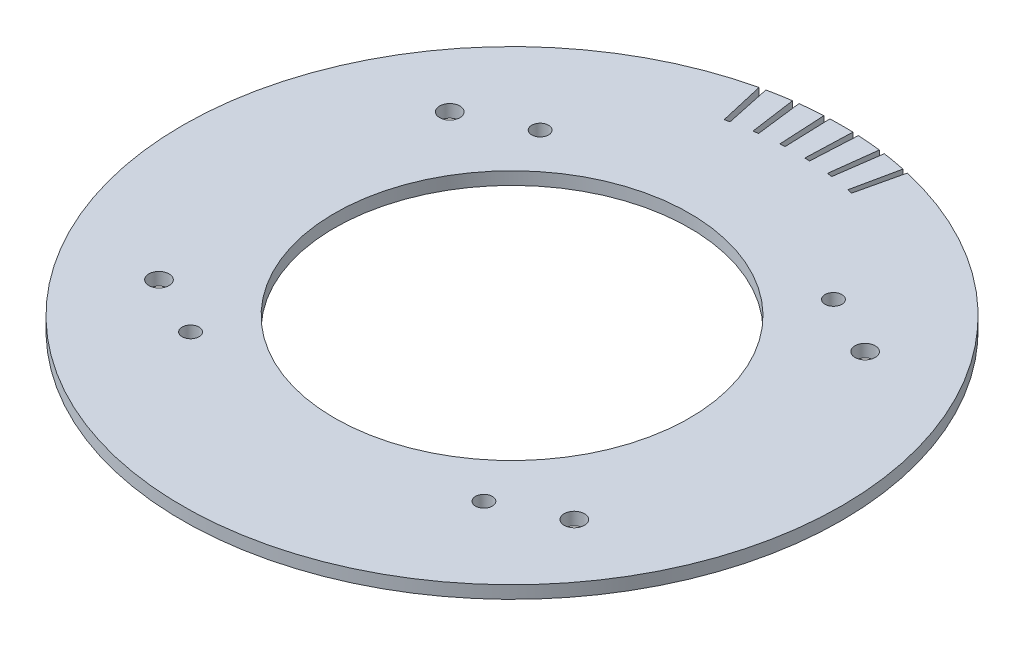
ISO-10303-21;
HEADER;
FILE_DESCRIPTION(('STEP AP214'),'2;1');
FILE_NAME('part.step','',(''),(''),'','','');
FILE_SCHEMA(('AUTOMOTIVE_DESIGN { 1 0 10303 214 1 1 1 1 }'));
ENDSEC;
DATA;
#1=APPLICATION_CONTEXT('core data for automotive mechanical design processes');
#2=APPLICATION_PROTOCOL_DEFINITION('international standard','automotive_design',2000,#1);
#3=PRODUCT_CONTEXT('',#1,'mechanical');
#4=PRODUCT('Part','Part','',(#3));
#5=PRODUCT_RELATED_PRODUCT_CATEGORY('part','',(#4));
#6=PRODUCT_DEFINITION_FORMATION('','',#4);
#7=PRODUCT_DEFINITION_CONTEXT('part definition',#1,'design');
#8=PRODUCT_DEFINITION('design','',#6,#7);
#9=PRODUCT_DEFINITION_SHAPE('','',#8);
#10=(LENGTH_UNIT() NAMED_UNIT(*) SI_UNIT(.MILLI.,.METRE.));
#11=(NAMED_UNIT(*) PLANE_ANGLE_UNIT() SI_UNIT($,.RADIAN.));
#12=(NAMED_UNIT(*) SI_UNIT($,.STERADIAN.) SOLID_ANGLE_UNIT());
#13=UNCERTAINTY_MEASURE_WITH_UNIT(LENGTH_MEASURE(1.E-05),#10,'distance_accuracy_value','');
#14=(GEOMETRIC_REPRESENTATION_CONTEXT(3) GLOBAL_UNCERTAINTY_ASSIGNED_CONTEXT((#13)) GLOBAL_UNIT_ASSIGNED_CONTEXT((#10,
#11,#12)) REPRESENTATION_CONTEXT('',''));
#15=CARTESIAN_POINT('',(0.,0.,0.));
#16=DIRECTION('',(0.,0.,1.));
#17=DIRECTION('',(1.,0.,0.));
#18=AXIS2_PLACEMENT_3D('',#15,#16,#17);
#19=CARTESIAN_POINT('',(0.,-1.905,0.));
#20=DIRECTION('',(0.,1.,0.));
#21=DIRECTION('',(0.,0.,1.));
#22=AXIS2_PLACEMENT_3D('',#19,#20,#21);
#23=CYLINDRICAL_SURFACE('',#22,99.06);
#24=CARTESIAN_POINT('',(0.,1.905,0.));
#25=DIRECTION('',(0.,1.,0.));
#26=DIRECTION('',(0.,0.,1.));
#27=AXIS2_PLACEMENT_3D('',#24,#25,#26);
#28=CIRCLE('',#27,99.06);
#29=CARTESIAN_POINT('',(-13.7864873811041,1.905,-98.09595488954));
#30=VERTEX_POINT('',#29);
#31=CARTESIAN_POINT('',(-20.5957320924073,1.905,-96.8953013286908));
#32=VERTEX_POINT('',#31);
#33=EDGE_CURVE('E418',#30,#32,#28,.T.);
#34=ORIENTED_EDGE('',*,*,#33,.F.);
#35=DIRECTION('',(0.,1.,0.));
#36=VECTOR('',#35,1.);
#37=CARTESIAN_POINT('',(-13.7864873811041,-1.905,-98.09595488954));
#38=LINE('',#37,#36);
#39=CARTESIAN_POINT('',(-13.7864873811041,-1.905,-98.09595488954));
#40=VERTEX_POINT('',#39);
#41=EDGE_CURVE('E248',#40,#30,#38,.T.);
#42=ORIENTED_EDGE('',*,*,#41,.F.);
#43=CARTESIAN_POINT('',(0.,-1.905,0.));
#44=DIRECTION('',(0.,1.,0.));
#45=DIRECTION('',(0.,0.,1.));
#46=AXIS2_PLACEMENT_3D('',#43,#44,#45);
#47=CIRCLE('',#46,99.06);
#48=CARTESIAN_POINT('',(-20.5957320924073,-1.905,-96.8953013286908));
#49=VERTEX_POINT('',#48);
#50=EDGE_CURVE('E437',#40,#49,#47,.T.);
#51=ORIENTED_EDGE('',*,*,#50,.T.);
#52=DIRECTION('',(0.,1.,0.));
#53=VECTOR('',#52,1.);
#54=CARTESIAN_POINT('',(-20.5957320924073,-1.905,-96.8953013286908));
#55=LINE('',#54,#53);
#56=EDGE_CURVE('E422',#49,#32,#55,.T.);
#57=ORIENTED_EDGE('',*,*,#56,.T.);
#58=EDGE_LOOP('',(#34,#42,#51,#57));
#59=FACE_BOUND('',#58,.T.);
#60=ADVANCED_FACE('F41',(#59),#23,.T.);
#61=DIRECTION('',(0.,1.,0.));
#62=VECTOR('',#61,1.);
#63=CARTESIAN_POINT('',(-12.0723771577139,-1.905,-98.3216217815893));
#64=LINE('',#63,#62);
#65=CARTESIAN_POINT('',(-12.0723771577139,-1.905,-98.3216217815893));
#66=VERTEX_POINT('',#65);
#67=CARTESIAN_POINT('',(-12.0723771577139,1.905,-98.3216217815893));
#68=VERTEX_POINT('',#67);
#69=EDGE_CURVE('E211',#66,#68,#64,.T.);
#70=ORIENTED_EDGE('',*,*,#69,.T.);
#71=CARTESIAN_POINT('',(-5.18439982542604,1.905,-98.9242417127881));
#72=VERTEX_POINT('',#71);
#73=EDGE_CURVE('E486',#72,#68,#28,.T.);
#74=ORIENTED_EDGE('',*,*,#73,.F.);
#75=DIRECTION('',(0.,1.,0.));
#76=VECTOR('',#75,1.);
#77=CARTESIAN_POINT('',(-5.18439982542604,-1.905,-98.9242417127881));
#78=LINE('',#77,#76);
#79=CARTESIAN_POINT('',(-5.18439982542604,-1.905,-98.9242417127881));
#80=VERTEX_POINT('',#79);
#81=EDGE_CURVE('E276',#80,#72,#78,.T.);
#82=ORIENTED_EDGE('',*,*,#81,.F.);
#83=EDGE_CURVE('E448',#80,#66,#47,.T.);
#84=ORIENTED_EDGE('',*,*,#83,.T.);
#85=EDGE_LOOP('',(#70,#74,#82,#84));
#86=FACE_BOUND('',#85,.T.);
#87=ADVANCED_FACE('F499',(#86),#23,.T.);
#88=DIRECTION('',(0.,1.,0.));
#89=VECTOR('',#88,1.);
#90=CARTESIAN_POINT('',(-3.45714414334976,-1.905,-98.9996553245116));
#91=LINE('',#90,#89);
#92=CARTESIAN_POINT('',(-3.45714414334976,-1.905,-98.9996553245116));
#93=VERTEX_POINT('',#92);
#94=CARTESIAN_POINT('',(-3.45714414334976,1.905,-98.9996553245116));
#95=VERTEX_POINT('',#94);
#96=EDGE_CURVE('E279',#93,#95,#91,.T.);
#97=ORIENTED_EDGE('',*,*,#96,.T.);
#98=CARTESIAN_POINT('',(3.45714414334975,1.905,-98.9996553245116));
#99=VERTEX_POINT('',#98);
#100=EDGE_CURVE('E481',#99,#95,#28,.T.);
#101=ORIENTED_EDGE('',*,*,#100,.F.);
#102=DIRECTION('',(0.,1.,0.));
#103=VECTOR('',#102,1.);
#104=CARTESIAN_POINT('',(3.45714414334975,-1.905,-98.9996553245116));
#105=LINE('',#104,#103);
#106=CARTESIAN_POINT('',(3.45714414334975,-1.905,-98.9996553245116));
#107=VERTEX_POINT('',#106);
#108=EDGE_CURVE('E311',#107,#99,#105,.T.);
#109=ORIENTED_EDGE('',*,*,#108,.F.);
#110=EDGE_CURVE('E453',#107,#93,#47,.T.);
#111=ORIENTED_EDGE('',*,*,#110,.T.);
#112=EDGE_LOOP('',(#97,#101,#109,#111));
#113=FACE_BOUND('',#112,.T.);
#114=ADVANCED_FACE('F503',(#113),#23,.T.);
#115=DIRECTION('',(0.,1.,0.));
#116=VECTOR('',#115,1.);
#117=CARTESIAN_POINT('',(5.18439982542603,-1.905,-98.9242417127881));
#118=LINE('',#117,#116);
#119=CARTESIAN_POINT('',(5.18439982542603,-1.905,-98.9242417127881));
#120=VERTEX_POINT('',#119);
#121=CARTESIAN_POINT('',(5.18439982542603,1.905,-98.9242417127881));
#122=VERTEX_POINT('',#121);
#123=EDGE_CURVE('E314',#120,#122,#118,.T.);
#124=ORIENTED_EDGE('',*,*,#123,.T.);
#125=CARTESIAN_POINT('',(12.0723771577139,1.905,-98.3216217815893));
#126=VERTEX_POINT('',#125);
#127=EDGE_CURVE('E479',#126,#122,#28,.T.);
#128=ORIENTED_EDGE('',*,*,#127,.F.);
#129=DIRECTION('',(0.,1.,0.));
#130=VECTOR('',#129,1.);
#131=CARTESIAN_POINT('',(12.0723771577139,-1.905,-98.3216217815893));
#132=LINE('',#131,#130);
#133=CARTESIAN_POINT('',(12.0723771577139,-1.905,-98.3216217815893));
#134=VERTEX_POINT('',#133);
#135=EDGE_CURVE('E347',#134,#126,#132,.T.);
#136=ORIENTED_EDGE('',*,*,#135,.F.);
#137=EDGE_CURVE('E446',#134,#120,#47,.T.);
#138=ORIENTED_EDGE('',*,*,#137,.T.);
#139=EDGE_LOOP('',(#124,#128,#136,#138));
#140=FACE_BOUND('',#139,.T.);
#141=ADVANCED_FACE('F466',(#140),#23,.T.);
#142=DIRECTION('',(0.,1.,0.));
#143=VECTOR('',#142,1.);
#144=CARTESIAN_POINT('',(13.7864873811041,-1.905,-98.0959548895399));
#145=LINE('',#144,#143);
#146=CARTESIAN_POINT('',(13.7864873811041,-1.905,-98.0959548895399));
#147=VERTEX_POINT('',#146);
#148=CARTESIAN_POINT('',(13.7864873811041,1.905,-98.0959548895399));
#149=VERTEX_POINT('',#148);
#150=EDGE_CURVE('E350',#147,#149,#145,.T.);
#151=ORIENTED_EDGE('',*,*,#150,.T.);
#152=CARTESIAN_POINT('',(20.5957320924073,1.905,-96.8953013286908));
#153=VERTEX_POINT('',#152);
#154=EDGE_CURVE('E434',#153,#149,#28,.T.);
#155=ORIENTED_EDGE('',*,*,#154,.F.);
#156=DIRECTION('',(0.,1.,0.));
#157=VECTOR('',#156,1.);
#158=CARTESIAN_POINT('',(20.5957320924073,-1.905,-96.8953013286908));
#159=LINE('',#158,#157);
#160=CARTESIAN_POINT('',(20.5957320924073,-1.905,-96.8953013286908));
#161=VERTEX_POINT('',#160);
#162=EDGE_CURVE('E382',#161,#153,#159,.T.);
#163=ORIENTED_EDGE('',*,*,#162,.F.);
#164=EDGE_CURVE('E440',#161,#147,#47,.T.);
#165=ORIENTED_EDGE('',*,*,#164,.T.);
#166=EDGE_LOOP('',(#151,#155,#163,#165));
#167=FACE_BOUND('',#166,.T.);
#168=ADVANCED_FACE('F506',(#167),#23,.T.);
#169=CARTESIAN_POINT('',(0.,-1.905,0.));
#170=DIRECTION('',(0.,1.,0.));
#171=DIRECTION('',(0.,0.,1.));
#172=AXIS2_PLACEMENT_3D('',#169,#170,#171);
#173=PLANE('',#172);
#174=CARTESIAN_POINT('',(-44.082374272303,-1.905,52.5353279090994));
#175=DIRECTION('',(0.,-1.,0.));
#176=DIRECTION('',(0.,0.,-1.));
#177=AXIS2_PLACEMENT_3D('',#174,#175,#176);
#178=CIRCLE('',#177,2.54000000000001);
#179=CARTESIAN_POINT('',(-44.082374272303,-1.905,49.9953279090994));
#180=VERTEX_POINT('',#179);
#181=EDGE_CURVE('E797',#180,#180,#178,.T.);
#182=ORIENTED_EDGE('',*,*,#181,.F.);
#183=EDGE_LOOP('',(#182));
#184=FACE_BOUND('',#183,.T.);
#185=CARTESIAN_POINT('',(44.082374272303,-1.905,52.5353279090994));
#186=DIRECTION('',(0.,-1.,0.));
#187=DIRECTION('',(0.,0.,-1.));
#188=AXIS2_PLACEMENT_3D('',#185,#186,#187);
#189=CIRCLE('',#188,2.54000000000001);
#190=CARTESIAN_POINT('',(44.082374272303,-1.905,49.9953279090994));
#191=VERTEX_POINT('',#190);
#192=EDGE_CURVE('E811',#191,#191,#189,.T.);
#193=ORIENTED_EDGE('',*,*,#192,.F.);
#194=EDGE_LOOP('',(#193));
#195=FACE_BOUND('',#194,.T.);
#196=CARTESIAN_POINT('',(62.4193857748213,-1.905,43.7065244499496));
#197=DIRECTION('',(0.,-1.,0.));
#198=DIRECTION('',(0.,0.,-1.));
#199=AXIS2_PLACEMENT_3D('',#196,#197,#198);
#200=CIRCLE('',#199,3.04800000000002);
#201=CARTESIAN_POINT('',(62.4193857748213,-1.905,40.6585244499496));
#202=VERTEX_POINT('',#201);
#203=EDGE_CURVE('E819',#202,#202,#200,.T.);
#204=ORIENTED_EDGE('',*,*,#203,.F.);
#205=EDGE_LOOP('',(#204));
#206=FACE_BOUND('',#205,.T.);
#207=CARTESIAN_POINT('',(62.4193857748213,-1.905,-43.7065244499496));
#208=DIRECTION('',(0.,-1.,0.));
#209=DIRECTION('',(0.,0.,-1.));
#210=AXIS2_PLACEMENT_3D('',#207,#208,#209);
#211=CIRCLE('',#210,3.04800000000002);
#212=CARTESIAN_POINT('',(62.4193857748213,-1.905,-46.7545244499496));
#213=VERTEX_POINT('',#212);
#214=EDGE_CURVE('E827',#213,#213,#211,.T.);
#215=ORIENTED_EDGE('',*,*,#214,.F.);
#216=EDGE_LOOP('',(#215));
#217=FACE_BOUND('',#216,.T.);
#218=CARTESIAN_POINT('',(44.082374272303,-1.905,-52.5353279090994));
#219=DIRECTION('',(0.,-1.,0.));
#220=DIRECTION('',(0.,0.,-1.));
#221=AXIS2_PLACEMENT_3D('',#218,#219,#220);
#222=CIRCLE('',#221,2.54);
#223=CARTESIAN_POINT('',(44.082374272303,-1.905,-55.0753279090994));
#224=VERTEX_POINT('',#223);
#225=EDGE_CURVE('E868',#224,#224,#222,.T.);
#226=ORIENTED_EDGE('',*,*,#225,.F.);
#227=EDGE_LOOP('',(#226));
#228=FACE_BOUND('',#227,.T.);
#229=CARTESIAN_POINT('',(-44.082374272303,-1.905,-52.5353279090994));
#230=DIRECTION('',(0.,-1.,0.));
#231=DIRECTION('',(0.,0.,-1.));
#232=AXIS2_PLACEMENT_3D('',#229,#230,#231);
#233=CIRCLE('',#232,2.54);
#234=CARTESIAN_POINT('',(-44.082374272303,-1.905,-55.0753279090994));
#235=VERTEX_POINT('',#234);
#236=EDGE_CURVE('E858',#235,#235,#233,.T.);
#237=ORIENTED_EDGE('',*,*,#236,.F.);
#238=EDGE_LOOP('',(#237));
#239=FACE_BOUND('',#238,.T.);
#240=CARTESIAN_POINT('',(-62.4193857748213,-1.905,-43.7065244499496));
#241=DIRECTION('',(0.,-1.,0.));
#242=DIRECTION('',(0.,0.,-1.));
#243=AXIS2_PLACEMENT_3D('',#240,#241,#242);
#244=CIRCLE('',#243,3.04800000000002);
#245=CARTESIAN_POINT('',(-62.4193857748213,-1.905,-46.7545244499496));
#246=VERTEX_POINT('',#245);
#247=EDGE_CURVE('E859',#246,#246,#244,.T.);
#248=ORIENTED_EDGE('',*,*,#247,.F.);
#249=EDGE_LOOP('',(#248));
#250=FACE_BOUND('',#249,.T.);
#251=CARTESIAN_POINT('',(-62.4193857748213,-1.905,43.7065244499496));
#252=DIRECTION('',(0.,-1.,0.));
#253=DIRECTION('',(0.,0.,-1.));
#254=AXIS2_PLACEMENT_3D('',#251,#252,#253);
#255=CIRCLE('',#254,3.048);
#256=CARTESIAN_POINT('',(-62.4193857748213,-1.905,40.6585244499496));
#257=VERTEX_POINT('',#256);
#258=EDGE_CURVE('E802',#257,#257,#255,.T.);
#259=ORIENTED_EDGE('',*,*,#258,.F.);
#260=EDGE_LOOP('',(#259));
#261=FACE_BOUND('',#260,.T.);
#262=CARTESIAN_POINT('',(0.,-1.905,0.));
#263=DIRECTION('',(0.,1.,0.));
#264=DIRECTION('',(0.,0.,1.));
#265=AXIS2_PLACEMENT_3D('',#262,#263,#264);
#266=CIRCLE('',#265,53.34);
#267=CARTESIAN_POINT('',(0.,-1.905,53.34));
#268=VERTEX_POINT('',#267);
#269=EDGE_CURVE('E11',#268,#268,#266,.T.);
#270=ORIENTED_EDGE('',*,*,#269,.T.);
#271=EDGE_LOOP('',(#270));
#272=FACE_BOUND('',#271,.T.);
#273=DIRECTION('',(-0.139173100960066,0.,-0.99026806874157));
#274=VECTOR('',#273,1.);
#275=CARTESIAN_POINT('',(0.,-1.905,0.));
#276=LINE('',#275,#274);
#277=CARTESIAN_POINT('',(-11.842239160692,-1.905,-84.2619099692202));
#278=VERTEX_POINT('',#277);
#279=EDGE_CURVE('E212',#278,#40,#276,.T.);
#280=ORIENTED_EDGE('',*,*,#279,.F.);
#281=CARTESIAN_POINT('',(0.,-1.905,0.));
#282=DIRECTION('',(0.,1.,0.));
#283=DIRECTION('',(-0.0871557427476584,0.,0.996194698091746));
#284=AXIS2_PLACEMENT_3D('',#281,#282,#283);
#285=CIRCLE('',#284,85.09);
#286=CARTESIAN_POINT('',(-10.369862430344,-1.905,-84.4557520431601));
#287=VERTEX_POINT('',#286);
#288=EDGE_CURVE('E206',#287,#278,#285,.T.);
#289=ORIENTED_EDGE('',*,*,#288,.F.);
#290=DIRECTION('',(-0.121869343405148,0.,-0.992546151641322));
#291=VECTOR('',#290,1.);
#292=CARTESIAN_POINT('',(0.,-1.905,0.));
#293=LINE('',#292,#291);
#294=EDGE_CURVE('E215',#287,#66,#293,.T.);
#295=ORIENTED_EDGE('',*,*,#294,.T.);
#296=ORIENTED_EDGE('',*,*,#83,.F.);
#297=DIRECTION('',(-0.0523359562429441,0.,-0.998629534754574));
#298=VECTOR('',#297,1.);
#299=CARTESIAN_POINT('',(0.,-1.905,0.));
#300=LINE('',#299,#298);
#301=CARTESIAN_POINT('',(-4.45326651671211,-1.905,-84.9733871122667));
#302=VERTEX_POINT('',#301);
#303=EDGE_CURVE('E261',#302,#80,#300,.T.);
#304=ORIENTED_EDGE('',*,*,#303,.F.);
#305=CARTESIAN_POINT('',(0.,-1.905,0.));
#306=DIRECTION('',(0.,1.,0.));
#307=DIRECTION('',(-0.173648177666931,0.,0.984807753012208));
#308=AXIS2_PLACEMENT_3D('',#305,#306,#307);
#309=CIRCLE('',#308,85.09);
#310=CARTESIAN_POINT('',(-2.96959817441582,-1.905,-85.0381654710549));
#311=VERTEX_POINT('',#310);
#312=EDGE_CURVE('E253',#311,#302,#309,.T.);
#313=ORIENTED_EDGE('',*,*,#312,.F.);
#314=DIRECTION('',(-0.0348994967025011,0.,-0.999390827019096));
#315=VECTOR('',#314,1.);
#316=CARTESIAN_POINT('',(0.,-1.905,0.));
#317=LINE('',#316,#315);
#318=EDGE_CURVE('E256',#311,#93,#317,.T.);
#319=ORIENTED_EDGE('',*,*,#318,.T.);
#320=ORIENTED_EDGE('',*,*,#110,.F.);
#321=DIRECTION('',(0.034899496702501,0.,-0.999390827019096));
#322=VECTOR('',#321,1.);
#323=CARTESIAN_POINT('',(0.,-1.905,0.));
#324=LINE('',#323,#322);
#325=CARTESIAN_POINT('',(2.96959817441581,-1.905,-85.0381654710549));
#326=VERTEX_POINT('',#325);
#327=EDGE_CURVE('E293',#326,#107,#324,.T.);
#328=ORIENTED_EDGE('',*,*,#327,.F.);
#329=CARTESIAN_POINT('',(0.,-1.905,0.));
#330=DIRECTION('',(0.,1.,0.));
#331=DIRECTION('',(-0.258819045102521,0.,0.965925826289068));
#332=AXIS2_PLACEMENT_3D('',#329,#330,#331);
#333=CIRCLE('',#332,85.09);
#334=CARTESIAN_POINT('',(4.4532665167121,-1.905,-84.9733871122667));
#335=VERTEX_POINT('',#334);
#336=EDGE_CURVE('E285',#335,#326,#333,.T.);
#337=ORIENTED_EDGE('',*,*,#336,.F.);
#338=DIRECTION('',(0.0523359562429439,0.,-0.998629534754574));
#339=VECTOR('',#338,1.);
#340=CARTESIAN_POINT('',(0.,-1.905,0.));
#341=LINE('',#340,#339);
#342=EDGE_CURVE('E288',#335,#120,#341,.T.);
#343=ORIENTED_EDGE('',*,*,#342,.T.);
#344=ORIENTED_EDGE('',*,*,#137,.F.);
#345=DIRECTION('',(0.121869343405148,0.,-0.992546151641322));
#346=VECTOR('',#345,1.);
#347=CARTESIAN_POINT('',(0.,-1.905,0.));
#348=LINE('',#347,#346);
#349=CARTESIAN_POINT('',(10.369862430344,-1.905,-84.4557520431601));
#350=VERTEX_POINT('',#349);
#351=EDGE_CURVE('E329',#350,#134,#348,.T.);
#352=ORIENTED_EDGE('',*,*,#351,.F.);
#353=CARTESIAN_POINT('',(0.,-1.905,0.));
#354=DIRECTION('',(0.,1.,0.));
#355=DIRECTION('',(-0.342020143325669,0.,0.939692620785908));
#356=AXIS2_PLACEMENT_3D('',#353,#354,#355);
#357=CIRCLE('',#356,85.09);
#358=CARTESIAN_POINT('',(11.842239160692,-1.905,-84.2619099692202));
#359=VERTEX_POINT('',#358);
#360=EDGE_CURVE('E321',#359,#350,#357,.T.);
#361=ORIENTED_EDGE('',*,*,#360,.F.);
#362=DIRECTION('',(0.139173100960066,0.,-0.99026806874157));
#363=VECTOR('',#362,1.);
#364=CARTESIAN_POINT('',(0.,-1.905,0.));
#365=LINE('',#364,#363);
#366=EDGE_CURVE('E324',#359,#147,#365,.T.);
#367=ORIENTED_EDGE('',*,*,#366,.T.);
#368=ORIENTED_EDGE('',*,*,#164,.F.);
#369=DIRECTION('',(0.20791169081776,0.,-0.978147600733806));
#370=VECTOR('',#369,1.);
#371=CARTESIAN_POINT('',(0.,-1.905,0.));
#372=LINE('',#371,#370);
#373=CARTESIAN_POINT('',(17.6912057716832,-1.905,-83.2305793464395));
#374=VERTEX_POINT('',#373);
#375=EDGE_CURVE('E365',#374,#161,#372,.T.);
#376=ORIENTED_EDGE('',*,*,#375,.F.);
#377=CARTESIAN_POINT('',(0.,-1.905,0.));
#378=DIRECTION('',(0.,1.,0.));
#379=DIRECTION('',(-0.4226182617407,0.,0.90630778703665));
#380=AXIS2_PLACEMENT_3D('',#377,#378,#379);
#381=CIRCLE('',#380,85.09);
#382=CARTESIAN_POINT('',(19.1410852141195,-1.905,-82.9091488125757));
#383=VERTEX_POINT('',#382);
#384=EDGE_CURVE('E357',#383,#374,#381,.T.);
#385=ORIENTED_EDGE('',*,*,#384,.F.);
#386=DIRECTION('',(0.224951054343865,0.,-0.974370064785235));
#387=VECTOR('',#386,1.);
#388=CARTESIAN_POINT('',(0.,-1.905,0.));
#389=LINE('',#388,#387);
#390=CARTESIAN_POINT('',(22.2836514433033,-1.905,-96.5210986176254));
#391=VERTEX_POINT('',#390);
#392=EDGE_CURVE('E360',#383,#391,#389,.T.);
#393=ORIENTED_EDGE('',*,*,#392,.T.);
#394=CARTESIAN_POINT('',(-22.2836514433033,-1.905,-96.5210986176254));
#395=VERTEX_POINT('',#394);
#396=EDGE_CURVE('E50',#395,#391,#47,.T.);
#397=ORIENTED_EDGE('',*,*,#396,.F.);
#398=DIRECTION('',(-0.224951054343866,0.,-0.974370064785235));
#399=VECTOR('',#398,1.);
#400=CARTESIAN_POINT('',(0.,-1.905,0.));
#401=LINE('',#400,#399);
#402=CARTESIAN_POINT('',(-19.1410852141195,-1.905,-82.9091488125757));
#403=VERTEX_POINT('',#402);
#404=EDGE_CURVE('E400',#403,#395,#401,.T.);
#405=ORIENTED_EDGE('',*,*,#404,.F.);
#406=CARTESIAN_POINT('',(0.,-1.905,0.));
#407=DIRECTION('',(0.,1.,0.));
#408=DIRECTION('',(0.,0.,1.));
#409=AXIS2_PLACEMENT_3D('',#406,#407,#408);
#410=CIRCLE('',#409,85.09);
#411=CARTESIAN_POINT('',(-17.6912057716832,-1.905,-83.2305793464395));
#412=VERTEX_POINT('',#411);
#413=EDGE_CURVE('E392',#412,#403,#410,.T.);
#414=ORIENTED_EDGE('',*,*,#413,.F.);
#415=DIRECTION('',(-0.20791169081776,0.,-0.978147600733805));
#416=VECTOR('',#415,1.);
#417=CARTESIAN_POINT('',(0.,-1.905,0.));
#418=LINE('',#417,#416);
#419=EDGE_CURVE('E395',#412,#49,#418,.T.);
#420=ORIENTED_EDGE('',*,*,#419,.T.);
#421=ORIENTED_EDGE('',*,*,#50,.F.);
#422=EDGE_LOOP('',(#280,#289,#295,#296,#304,#313,#319,#320,#328,#337,#343,#344,#352,#361,#367,
#368,#376,#385,#393,#397,#405,#414,#420,#421));
#423=FACE_BOUND('',#422,.T.);
#424=ADVANCED_FACE('F224',(#184,#195,#206,#217,#228,#239,#250,#261,#272,#423),#173,.F.);
#425=CARTESIAN_POINT('',(0.,1.905,0.));
#426=DIRECTION('',(0.,1.,0.));
#427=DIRECTION('',(0.,0.,1.));
#428=AXIS2_PLACEMENT_3D('',#425,#426,#427);
#429=PLANE('',#428);
#430=CARTESIAN_POINT('',(-44.082374272303,1.905,52.5353279090994));
#431=DIRECTION('',(0.,1.,0.));
#432=DIRECTION('',(0.,0.,1.));
#433=AXIS2_PLACEMENT_3D('',#430,#431,#432);
#434=CIRCLE('',#433,2.54000000000001);
#435=CARTESIAN_POINT('',(-44.082374272303,1.905,55.0753279090994));
#436=VERTEX_POINT('',#435);
#437=EDGE_CURVE('E800',#436,#436,#434,.F.);
#438=ORIENTED_EDGE('',*,*,#437,.T.);
#439=EDGE_LOOP('',(#438));
#440=FACE_BOUND('',#439,.T.);
#441=CARTESIAN_POINT('',(44.082374272303,1.905,52.5353279090994));
#442=DIRECTION('',(0.,1.,0.));
#443=DIRECTION('',(0.,0.,1.));
#444=AXIS2_PLACEMENT_3D('',#441,#442,#443);
#445=CIRCLE('',#444,2.54000000000001);
#446=CARTESIAN_POINT('',(44.082374272303,1.905,55.0753279090994));
#447=VERTEX_POINT('',#446);
#448=EDGE_CURVE('E807',#447,#447,#445,.F.);
#449=ORIENTED_EDGE('',*,*,#448,.T.);
#450=EDGE_LOOP('',(#449));
#451=FACE_BOUND('',#450,.T.);
#452=CARTESIAN_POINT('',(62.4193857748213,1.905,43.7065244499496));
#453=DIRECTION('',(0.,1.,0.));
#454=DIRECTION('',(0.,0.,1.));
#455=AXIS2_PLACEMENT_3D('',#452,#453,#454);
#456=CIRCLE('',#455,3.04800000000002);
#457=CARTESIAN_POINT('',(62.4193857748213,1.905,46.7545244499496));
#458=VERTEX_POINT('',#457);
#459=EDGE_CURVE('E815',#458,#458,#456,.F.);
#460=ORIENTED_EDGE('',*,*,#459,.T.);
#461=EDGE_LOOP('',(#460));
#462=FACE_BOUND('',#461,.T.);
#463=CARTESIAN_POINT('',(62.4193857748213,1.905,-43.7065244499496));
#464=DIRECTION('',(0.,1.,0.));
#465=DIRECTION('',(0.,0.,1.));
#466=AXIS2_PLACEMENT_3D('',#463,#464,#465);
#467=CIRCLE('',#466,3.04800000000002);
#468=CARTESIAN_POINT('',(62.4193857748213,1.905,-40.6585244499496));
#469=VERTEX_POINT('',#468);
#470=EDGE_CURVE('E823',#469,#469,#467,.F.);
#471=ORIENTED_EDGE('',*,*,#470,.T.);
#472=EDGE_LOOP('',(#471));
#473=FACE_BOUND('',#472,.T.);
#474=CARTESIAN_POINT('',(44.082374272303,1.905,-52.5353279090994));
#475=DIRECTION('',(0.,1.,0.));
#476=DIRECTION('',(0.,0.,1.));
#477=AXIS2_PLACEMENT_3D('',#474,#475,#476);
#478=CIRCLE('',#477,2.54);
#479=CARTESIAN_POINT('',(44.082374272303,1.905,-49.9953279090994));
#480=VERTEX_POINT('',#479);
#481=EDGE_CURVE('E831',#480,#480,#478,.F.);
#482=ORIENTED_EDGE('',*,*,#481,.T.);
#483=EDGE_LOOP('',(#482));
#484=FACE_BOUND('',#483,.T.);
#485=CARTESIAN_POINT('',(-44.082374272303,1.905,-52.5353279090994));
#486=DIRECTION('',(0.,1.,0.));
#487=DIRECTION('',(0.,0.,1.));
#488=AXIS2_PLACEMENT_3D('',#485,#486,#487);
#489=CIRCLE('',#488,2.54);
#490=CARTESIAN_POINT('',(-44.082374272303,1.905,-49.9953279090994));
#491=VERTEX_POINT('',#490);
#492=EDGE_CURVE('E844',#491,#491,#489,.F.);
#493=ORIENTED_EDGE('',*,*,#492,.T.);
#494=EDGE_LOOP('',(#493));
#495=FACE_BOUND('',#494,.T.);
#496=CARTESIAN_POINT('',(-62.4193857748213,1.905,-43.7065244499496));
#497=DIRECTION('',(0.,1.,0.));
#498=DIRECTION('',(0.,0.,1.));
#499=AXIS2_PLACEMENT_3D('',#496,#497,#498);
#500=CIRCLE('',#499,3.04800000000002);
#501=CARTESIAN_POINT('',(-62.4193857748213,1.905,-40.6585244499496));
#502=VERTEX_POINT('',#501);
#503=EDGE_CURVE('E848',#502,#502,#500,.F.);
#504=ORIENTED_EDGE('',*,*,#503,.T.);
#505=EDGE_LOOP('',(#504));
#506=FACE_BOUND('',#505,.T.);
#507=CARTESIAN_POINT('',(-62.4193857748213,1.905,43.7065244499496));
#508=DIRECTION('',(0.,1.,0.));
#509=DIRECTION('',(0.,0.,1.));
#510=AXIS2_PLACEMENT_3D('',#507,#508,#509);
#511=CIRCLE('',#510,3.048);
#512=CARTESIAN_POINT('',(-62.4193857748213,1.905,46.7545244499496));
#513=VERTEX_POINT('',#512);
#514=EDGE_CURVE('E234',#513,#513,#511,.F.);
#515=ORIENTED_EDGE('',*,*,#514,.T.);
#516=EDGE_LOOP('',(#515));
#517=FACE_BOUND('',#516,.T.);
#518=CARTESIAN_POINT('',(0.,1.905,0.));
#519=DIRECTION('',(0.,1.,0.));
#520=DIRECTION('',(0.,0.,1.));
#521=AXIS2_PLACEMENT_3D('',#518,#519,#520);
#522=CIRCLE('',#521,53.34);
#523=CARTESIAN_POINT('',(0.,1.905,53.34));
#524=VERTEX_POINT('',#523);
#525=EDGE_CURVE('E433',#524,#524,#522,.T.);
#526=ORIENTED_EDGE('',*,*,#525,.F.);
#527=EDGE_LOOP('',(#526));
#528=FACE_BOUND('',#527,.T.);
#529=CARTESIAN_POINT('',(0.,1.905,0.));
#530=DIRECTION('',(0.,1.,0.));
#531=DIRECTION('',(-0.0871557427476584,0.,0.996194698091746));
#532=AXIS2_PLACEMENT_3D('',#529,#530,#531);
#533=CIRCLE('',#532,85.09);
#534=CARTESIAN_POINT('',(-10.369862430344,1.905,-84.4557520431601));
#535=VERTEX_POINT('',#534);
#536=CARTESIAN_POINT('',(-11.842239160692,1.905,-84.2619099692202));
#537=VERTEX_POINT('',#536);
#538=EDGE_CURVE('E57',#535,#537,#533,.T.);
#539=ORIENTED_EDGE('',*,*,#538,.T.);
#540=DIRECTION('',(-0.139173100960066,0.,-0.99026806874157));
#541=VECTOR('',#540,1.);
#542=CARTESIAN_POINT('',(0.,1.905,0.));
#543=LINE('',#542,#541);
#544=EDGE_CURVE('E227',#537,#30,#543,.T.);
#545=ORIENTED_EDGE('',*,*,#544,.T.);
#546=ORIENTED_EDGE('',*,*,#33,.T.);
#547=DIRECTION('',(-0.20791169081776,0.,-0.978147600733805));
#548=VECTOR('',#547,1.);
#549=CARTESIAN_POINT('',(0.,1.905,0.));
#550=LINE('',#549,#548);
#551=CARTESIAN_POINT('',(-17.6912057716832,1.905,-83.2305793464395));
#552=VERTEX_POINT('',#551);
#553=EDGE_CURVE('E407',#552,#32,#550,.T.);
#554=ORIENTED_EDGE('',*,*,#553,.F.);
#555=CARTESIAN_POINT('',(0.,1.905,0.));
#556=DIRECTION('',(0.,1.,0.));
#557=DIRECTION('',(0.,0.,1.));
#558=AXIS2_PLACEMENT_3D('',#555,#556,#557);
#559=CIRCLE('',#558,85.09);
#560=CARTESIAN_POINT('',(-19.1410852141195,1.905,-82.9091488125757));
#561=VERTEX_POINT('',#560);
#562=EDGE_CURVE('E247',#552,#561,#559,.T.);
#563=ORIENTED_EDGE('',*,*,#562,.T.);
#564=DIRECTION('',(-0.224951054343866,0.,-0.974370064785235));
#565=VECTOR('',#564,1.);
#566=CARTESIAN_POINT('',(0.,1.905,0.));
#567=LINE('',#566,#565);
#568=CARTESIAN_POINT('',(-22.2836514433033,1.905,-96.5210986176254));
#569=VERTEX_POINT('',#568);
#570=EDGE_CURVE('E396',#561,#569,#567,.T.);
#571=ORIENTED_EDGE('',*,*,#570,.T.);
#572=CARTESIAN_POINT('',(22.2836514433033,1.905,-96.5210986176254));
#573=VERTEX_POINT('',#572);
#574=EDGE_CURVE('E429',#569,#573,#28,.T.);
#575=ORIENTED_EDGE('',*,*,#574,.T.);
#576=DIRECTION('',(0.224951054343865,0.,-0.974370064785235));
#577=VECTOR('',#576,1.);
#578=CARTESIAN_POINT('',(0.,1.905,0.));
#579=LINE('',#578,#577);
#580=CARTESIAN_POINT('',(19.1410852141195,1.905,-82.9091488125757));
#581=VERTEX_POINT('',#580);
#582=EDGE_CURVE('E373',#581,#573,#579,.T.);
#583=ORIENTED_EDGE('',*,*,#582,.F.);
#584=CARTESIAN_POINT('',(0.,1.905,0.));
#585=DIRECTION('',(0.,1.,0.));
#586=DIRECTION('',(-0.4226182617407,0.,0.90630778703665));
#587=AXIS2_PLACEMENT_3D('',#584,#585,#586);
#588=CIRCLE('',#587,85.09);
#589=CARTESIAN_POINT('',(17.6912057716832,1.905,-83.2305793464395));
#590=VERTEX_POINT('',#589);
#591=EDGE_CURVE('E369',#581,#590,#588,.T.);
#592=ORIENTED_EDGE('',*,*,#591,.T.);
#593=DIRECTION('',(0.20791169081776,0.,-0.978147600733806));
#594=VECTOR('',#593,1.);
#595=CARTESIAN_POINT('',(0.,1.905,0.));
#596=LINE('',#595,#594);
#597=EDGE_CURVE('E361',#590,#153,#596,.T.);
#598=ORIENTED_EDGE('',*,*,#597,.T.);
#599=ORIENTED_EDGE('',*,*,#154,.T.);
#600=DIRECTION('',(0.139173100960066,0.,-0.99026806874157));
#601=VECTOR('',#600,1.);
#602=CARTESIAN_POINT('',(0.,1.905,0.));
#603=LINE('',#602,#601);
#604=CARTESIAN_POINT('',(11.842239160692,1.905,-84.2619099692202));
#605=VERTEX_POINT('',#604);
#606=EDGE_CURVE('E337',#605,#149,#603,.T.);
#607=ORIENTED_EDGE('',*,*,#606,.F.);
#608=CARTESIAN_POINT('',(0.,1.905,0.));
#609=DIRECTION('',(0.,1.,0.));
#610=DIRECTION('',(-0.342020143325669,0.,0.939692620785908));
#611=AXIS2_PLACEMENT_3D('',#608,#609,#610);
#612=CIRCLE('',#611,85.09);
#613=CARTESIAN_POINT('',(10.369862430344,1.905,-84.4557520431601));
#614=VERTEX_POINT('',#613);
#615=EDGE_CURVE('E333',#605,#614,#612,.T.);
#616=ORIENTED_EDGE('',*,*,#615,.T.);
#617=DIRECTION('',(0.121869343405148,0.,-0.992546151641322));
#618=VECTOR('',#617,1.);
#619=CARTESIAN_POINT('',(0.,1.905,0.));
#620=LINE('',#619,#618);
#621=EDGE_CURVE('E325',#614,#126,#620,.T.);
#622=ORIENTED_EDGE('',*,*,#621,.T.);
#623=ORIENTED_EDGE('',*,*,#127,.T.);
#624=DIRECTION('',(0.0523359562429439,0.,-0.998629534754574));
#625=VECTOR('',#624,1.);
#626=CARTESIAN_POINT('',(0.,1.905,0.));
#627=LINE('',#626,#625);
#628=CARTESIAN_POINT('',(4.4532665167121,1.905,-84.9733871122667));
#629=VERTEX_POINT('',#628);
#630=EDGE_CURVE('E301',#629,#122,#627,.T.);
#631=ORIENTED_EDGE('',*,*,#630,.F.);
#632=CARTESIAN_POINT('',(0.,1.905,0.));
#633=DIRECTION('',(0.,1.,0.));
#634=DIRECTION('',(-0.258819045102521,0.,0.965925826289068));
#635=AXIS2_PLACEMENT_3D('',#632,#633,#634);
#636=CIRCLE('',#635,85.09);
#637=CARTESIAN_POINT('',(2.96959817441581,1.905,-85.0381654710549));
#638=VERTEX_POINT('',#637);
#639=EDGE_CURVE('E297',#629,#638,#636,.T.);
#640=ORIENTED_EDGE('',*,*,#639,.T.);
#641=DIRECTION('',(0.034899496702501,0.,-0.999390827019096));
#642=VECTOR('',#641,1.);
#643=CARTESIAN_POINT('',(0.,1.905,0.));
#644=LINE('',#643,#642);
#645=EDGE_CURVE('E289',#638,#99,#644,.T.);
#646=ORIENTED_EDGE('',*,*,#645,.T.);
#647=ORIENTED_EDGE('',*,*,#100,.T.);
#648=DIRECTION('',(-0.0348994967025011,0.,-0.999390827019096));
#649=VECTOR('',#648,1.);
#650=CARTESIAN_POINT('',(0.,1.905,0.));
#651=LINE('',#650,#649);
#652=CARTESIAN_POINT('',(-2.96959817441582,1.905,-85.0381654710549));
#653=VERTEX_POINT('',#652);
#654=EDGE_CURVE('E267',#653,#95,#651,.T.);
#655=ORIENTED_EDGE('',*,*,#654,.F.);
#656=CARTESIAN_POINT('',(0.,1.905,0.));
#657=DIRECTION('',(0.,1.,0.));
#658=DIRECTION('',(-0.173648177666931,0.,0.984807753012208));
#659=AXIS2_PLACEMENT_3D('',#656,#657,#658);
#660=CIRCLE('',#659,85.09);
#661=CARTESIAN_POINT('',(-4.45326651671211,1.905,-84.9733871122667));
#662=VERTEX_POINT('',#661);
#663=EDGE_CURVE('E65',#653,#662,#660,.T.);
#664=ORIENTED_EDGE('',*,*,#663,.T.);
#665=DIRECTION('',(-0.0523359562429441,0.,-0.998629534754574));
#666=VECTOR('',#665,1.);
#667=CARTESIAN_POINT('',(0.,1.905,0.));
#668=LINE('',#667,#666);
#669=EDGE_CURVE('E257',#662,#72,#668,.T.);
#670=ORIENTED_EDGE('',*,*,#669,.T.);
#671=ORIENTED_EDGE('',*,*,#73,.T.);
#672=DIRECTION('',(-0.121869343405148,0.,-0.992546151641322));
#673=VECTOR('',#672,1.);
#674=CARTESIAN_POINT('',(0.,1.905,0.));
#675=LINE('',#674,#673);
#676=EDGE_CURVE('E231',#535,#68,#675,.T.);
#677=ORIENTED_EDGE('',*,*,#676,.F.);
#678=EDGE_LOOP('',(#539,#545,#546,#554,#563,#571,#575,#583,#592,#598,#599,#607,#616,#622,#623,
#631,#640,#646,#647,#655,#664,#670,#671,#677));
#679=FACE_BOUND('',#678,.T.);
#680=ADVANCED_FACE('F478',(#440,#451,#462,#473,#484,#495,#506,#517,#528,#679),#429,.T.);
#681=DIRECTION('',(0.,1.,0.));
#682=VECTOR('',#681,1.);
#683=CARTESIAN_POINT('',(22.2836514433033,-1.905,-96.5210986176254));
#684=LINE('',#683,#682);
#685=EDGE_CURVE('E385',#391,#573,#684,.T.);
#686=ORIENTED_EDGE('',*,*,#685,.T.);
#687=ORIENTED_EDGE('',*,*,#574,.F.);
#688=DIRECTION('',(0.,1.,0.));
#689=VECTOR('',#688,1.);
#690=CARTESIAN_POINT('',(-22.2836514433033,-1.905,-96.5210986176254));
#691=LINE('',#690,#689);
#692=EDGE_CURVE('E419',#395,#569,#691,.T.);
#693=ORIENTED_EDGE('',*,*,#692,.F.);
#694=ORIENTED_EDGE('',*,*,#396,.T.);
#695=EDGE_LOOP('',(#686,#687,#693,#694));
#696=FACE_BOUND('',#695,.T.);
#697=ADVANCED_FACE('F43',(#696),#23,.T.);
#698=CARTESIAN_POINT('',(0.,-1.905,0.));
#699=DIRECTION('',(0.,1.,0.));
#700=DIRECTION('',(0.,0.,1.));
#701=AXIS2_PLACEMENT_3D('',#698,#699,#700);
#702=CYLINDRICAL_SURFACE('',#701,53.34);
#703=ORIENTED_EDGE('',*,*,#269,.F.);
#704=EDGE_LOOP('',(#703));
#705=FACE_BOUND('',#704,.T.);
#706=ORIENTED_EDGE('',*,*,#525,.T.);
#707=EDGE_LOOP('',(#706));
#708=FACE_BOUND('',#707,.T.);
#709=ADVANCED_FACE('F505',(#705,#708),#702,.F.);
#710=CARTESIAN_POINT('',(0.,-1.905,0.));
#711=DIRECTION('',(0.,1.,0.));
#712=DIRECTION('',(0.,0.,1.));
#713=AXIS2_PLACEMENT_3D('',#710,#711,#712);
#714=CYLINDRICAL_SURFACE('',#713,85.09);
#715=ORIENTED_EDGE('',*,*,#562,.F.);
#716=DIRECTION('',(0.,1.,0.));
#717=VECTOR('',#716,1.);
#718=CARTESIAN_POINT('',(-17.6912057716832,-1.905,-83.2305793464395));
#719=LINE('',#718,#717);
#720=EDGE_CURVE('E403',#412,#552,#719,.T.);
#721=ORIENTED_EDGE('',*,*,#720,.F.);
#722=ORIENTED_EDGE('',*,*,#413,.T.);
#723=DIRECTION('',(0.,1.,0.));
#724=VECTOR('',#723,1.);
#725=CARTESIAN_POINT('',(-19.1410852141195,-1.905,-82.9091488125757));
#726=LINE('',#725,#724);
#727=EDGE_CURVE('E414',#403,#561,#726,.T.);
#728=ORIENTED_EDGE('',*,*,#727,.T.);
#729=EDGE_LOOP('',(#715,#721,#722,#728));
#730=FACE_BOUND('',#729,.T.);
#731=ADVANCED_FACE('F511',(#730),#714,.T.);
#732=CARTESIAN_POINT('',(0.,-1.905,0.));
#733=DIRECTION('',(0.974370064785235,0.,-0.224951054343866));
#734=DIRECTION('',(-0.224951054343866,0.,-0.974370064785235));
#735=AXIS2_PLACEMENT_3D('',#732,#733,#734);
#736=PLANE('',#735);
#737=ORIENTED_EDGE('',*,*,#570,.F.);
#738=ORIENTED_EDGE('',*,*,#727,.F.);
#739=ORIENTED_EDGE('',*,*,#404,.T.);
#740=ORIENTED_EDGE('',*,*,#692,.T.);
#741=EDGE_LOOP('',(#737,#738,#739,#740));
#742=FACE_BOUND('',#741,.T.);
#743=ADVANCED_FACE('F564',(#742),#736,.T.);
#744=CARTESIAN_POINT('',(0.,-1.905,0.));
#745=DIRECTION('',(0.978147600733805,0.,-0.20791169081776));
#746=DIRECTION('',(-0.20791169081776,0.,-0.978147600733806));
#747=AXIS2_PLACEMENT_3D('',#744,#745,#746);
#748=PLANE('',#747);
#749=ORIENTED_EDGE('',*,*,#553,.T.);
#750=ORIENTED_EDGE('',*,*,#56,.F.);
#751=ORIENTED_EDGE('',*,*,#419,.F.);
#752=ORIENTED_EDGE('',*,*,#720,.T.);
#753=EDGE_LOOP('',(#749,#750,#751,#752));
#754=FACE_BOUND('',#753,.T.);
#755=ADVANCED_FACE('F496',(#754),#748,.F.);
#756=CARTESIAN_POINT('',(0.,-1.905,0.));
#757=DIRECTION('',(0.,1.,0.));
#758=DIRECTION('',(0.,0.,1.));
#759=AXIS2_PLACEMENT_3D('',#756,#757,#758);
#760=CYLINDRICAL_SURFACE('',#759,85.09);
#761=ORIENTED_EDGE('',*,*,#591,.F.);
#762=DIRECTION('',(0.,1.,0.));
#763=VECTOR('',#762,1.);
#764=CARTESIAN_POINT('',(19.1410852141195,-1.905,-82.9091488125757));
#765=LINE('',#764,#763);
#766=EDGE_CURVE('E368',#383,#581,#765,.T.);
#767=ORIENTED_EDGE('',*,*,#766,.F.);
#768=ORIENTED_EDGE('',*,*,#384,.T.);
#769=DIRECTION('',(0.,1.,0.));
#770=VECTOR('',#769,1.);
#771=CARTESIAN_POINT('',(17.6912057716832,-1.905,-83.2305793464395));
#772=LINE('',#771,#770);
#773=EDGE_CURVE('E338',#374,#590,#772,.T.);
#774=ORIENTED_EDGE('',*,*,#773,.T.);
#775=EDGE_LOOP('',(#761,#767,#768,#774));
#776=FACE_BOUND('',#775,.T.);
#777=ADVANCED_FACE('F535',(#776),#760,.T.);
#778=CARTESIAN_POINT('',(0.,-1.905,0.));
#779=DIRECTION('',(0.978147600733806,0.,0.20791169081776));
#780=DIRECTION('',(0.20791169081776,0.,-0.978147600733806));
#781=AXIS2_PLACEMENT_3D('',#778,#779,#780);
#782=PLANE('',#781);
#783=ORIENTED_EDGE('',*,*,#597,.F.);
#784=ORIENTED_EDGE('',*,*,#773,.F.);
#785=ORIENTED_EDGE('',*,*,#375,.T.);
#786=ORIENTED_EDGE('',*,*,#162,.T.);
#787=EDGE_LOOP('',(#783,#784,#785,#786));
#788=FACE_BOUND('',#787,.T.);
#789=ADVANCED_FACE('F532',(#788),#782,.T.);
#790=CARTESIAN_POINT('',(0.,-1.905,0.));
#791=DIRECTION('',(0.974370064785235,0.,0.224951054343865));
#792=DIRECTION('',(0.224951054343865,0.,-0.974370064785235));
#793=AXIS2_PLACEMENT_3D('',#790,#791,#792);
#794=PLANE('',#793);
#795=ORIENTED_EDGE('',*,*,#582,.T.);
#796=ORIENTED_EDGE('',*,*,#685,.F.);
#797=ORIENTED_EDGE('',*,*,#392,.F.);
#798=ORIENTED_EDGE('',*,*,#766,.T.);
#799=EDGE_LOOP('',(#795,#796,#797,#798));
#800=FACE_BOUND('',#799,.T.);
#801=ADVANCED_FACE('F552',(#800),#794,.F.);
#802=CARTESIAN_POINT('',(0.,-1.905,0.));
#803=DIRECTION('',(0.,1.,0.));
#804=DIRECTION('',(0.,0.,1.));
#805=AXIS2_PLACEMENT_3D('',#802,#803,#804);
#806=CYLINDRICAL_SURFACE('',#805,85.09);
#807=ORIENTED_EDGE('',*,*,#615,.F.);
#808=DIRECTION('',(0.,1.,0.));
#809=VECTOR('',#808,1.);
#810=CARTESIAN_POINT('',(11.842239160692,-1.905,-84.2619099692202));
#811=LINE('',#810,#809);
#812=EDGE_CURVE('E332',#359,#605,#811,.T.);
#813=ORIENTED_EDGE('',*,*,#812,.F.);
#814=ORIENTED_EDGE('',*,*,#360,.T.);
#815=DIRECTION('',(0.,1.,0.));
#816=VECTOR('',#815,1.);
#817=CARTESIAN_POINT('',(10.369862430344,-1.905,-84.4557520431601));
#818=LINE('',#817,#816);
#819=EDGE_CURVE('E302',#350,#614,#818,.T.);
#820=ORIENTED_EDGE('',*,*,#819,.T.);
#821=EDGE_LOOP('',(#807,#813,#814,#820));
#822=FACE_BOUND('',#821,.T.);
#823=ADVANCED_FACE('F540',(#822),#806,.T.);
#824=CARTESIAN_POINT('',(0.,-1.905,0.));
#825=DIRECTION('',(0.992546151641322,0.,0.121869343405148));
#826=DIRECTION('',(0.121869343405148,0.,-0.992546151641322));
#827=AXIS2_PLACEMENT_3D('',#824,#825,#826);
#828=PLANE('',#827);
#829=ORIENTED_EDGE('',*,*,#621,.F.);
#830=ORIENTED_EDGE('',*,*,#819,.F.);
#831=ORIENTED_EDGE('',*,*,#351,.T.);
#832=ORIENTED_EDGE('',*,*,#135,.T.);
#833=EDGE_LOOP('',(#829,#830,#831,#832));
#834=FACE_BOUND('',#833,.T.);
#835=ADVANCED_FACE('F543',(#834),#828,.T.);
#836=CARTESIAN_POINT('',(0.,-1.905,0.));
#837=DIRECTION('',(0.99026806874157,0.,0.139173100960066));
#838=DIRECTION('',(0.139173100960066,0.,-0.99026806874157));
#839=AXIS2_PLACEMENT_3D('',#836,#837,#838);
#840=PLANE('',#839);
#841=ORIENTED_EDGE('',*,*,#606,.T.);
#842=ORIENTED_EDGE('',*,*,#150,.F.);
#843=ORIENTED_EDGE('',*,*,#366,.F.);
#844=ORIENTED_EDGE('',*,*,#812,.T.);
#845=EDGE_LOOP('',(#841,#842,#843,#844));
#846=FACE_BOUND('',#845,.T.);
#847=ADVANCED_FACE('F538',(#846),#840,.F.);
#848=CARTESIAN_POINT('',(0.,-1.905,0.));
#849=DIRECTION('',(0.,1.,0.));
#850=DIRECTION('',(0.,0.,1.));
#851=AXIS2_PLACEMENT_3D('',#848,#849,#850);
#852=CYLINDRICAL_SURFACE('',#851,85.09);
#853=ORIENTED_EDGE('',*,*,#639,.F.);
#854=DIRECTION('',(0.,1.,0.));
#855=VECTOR('',#854,1.);
#856=CARTESIAN_POINT('',(4.4532665167121,-1.905,-84.9733871122667));
#857=LINE('',#856,#855);
#858=EDGE_CURVE('E296',#335,#629,#857,.T.);
#859=ORIENTED_EDGE('',*,*,#858,.F.);
#860=ORIENTED_EDGE('',*,*,#336,.T.);
#861=DIRECTION('',(0.,1.,0.));
#862=VECTOR('',#861,1.);
#863=CARTESIAN_POINT('',(2.96959817441581,-1.905,-85.0381654710549));
#864=LINE('',#863,#862);
#865=EDGE_CURVE('E268',#326,#638,#864,.T.);
#866=ORIENTED_EDGE('',*,*,#865,.T.);
#867=EDGE_LOOP('',(#853,#859,#860,#866));
#868=FACE_BOUND('',#867,.T.);
#869=ADVANCED_FACE('F550',(#868),#852,.T.);
#870=CARTESIAN_POINT('',(0.,-1.905,0.));
#871=DIRECTION('',(0.999390827019096,0.,0.034899496702501));
#872=DIRECTION('',(0.034899496702501,0.,-0.999390827019096));
#873=AXIS2_PLACEMENT_3D('',#870,#871,#872);
#874=PLANE('',#873);
#875=ORIENTED_EDGE('',*,*,#645,.F.);
#876=ORIENTED_EDGE('',*,*,#865,.F.);
#877=ORIENTED_EDGE('',*,*,#327,.T.);
#878=ORIENTED_EDGE('',*,*,#108,.T.);
#879=EDGE_LOOP('',(#875,#876,#877,#878));
#880=FACE_BOUND('',#879,.T.);
#881=ADVANCED_FACE('F623',(#880),#874,.T.);
#882=CARTESIAN_POINT('',(0.,-1.905,0.));
#883=DIRECTION('',(0.998629534754574,0.,0.0523359562429439));
#884=DIRECTION('',(0.0523359562429439,0.,-0.998629534754574));
#885=AXIS2_PLACEMENT_3D('',#882,#883,#884);
#886=PLANE('',#885);
#887=ORIENTED_EDGE('',*,*,#630,.T.);
#888=ORIENTED_EDGE('',*,*,#123,.F.);
#889=ORIENTED_EDGE('',*,*,#342,.F.);
#890=ORIENTED_EDGE('',*,*,#858,.T.);
#891=EDGE_LOOP('',(#887,#888,#889,#890));
#892=FACE_BOUND('',#891,.T.);
#893=ADVANCED_FACE('F475',(#892),#886,.F.);
#894=CARTESIAN_POINT('',(0.,-1.905,0.));
#895=DIRECTION('',(0.,1.,0.));
#896=DIRECTION('',(0.,0.,1.));
#897=AXIS2_PLACEMENT_3D('',#894,#895,#896);
#898=CYLINDRICAL_SURFACE('',#897,85.09);
#899=ORIENTED_EDGE('',*,*,#663,.F.);
#900=DIRECTION('',(0.,1.,0.));
#901=VECTOR('',#900,1.);
#902=CARTESIAN_POINT('',(-2.96959817441582,-1.905,-85.0381654710549));
#903=LINE('',#902,#901);
#904=EDGE_CURVE('E264',#311,#653,#903,.T.);
#905=ORIENTED_EDGE('',*,*,#904,.F.);
#906=ORIENTED_EDGE('',*,*,#312,.T.);
#907=DIRECTION('',(0.,1.,0.));
#908=VECTOR('',#907,1.);
#909=CARTESIAN_POINT('',(-4.45326651671211,-1.905,-84.9733871122667));
#910=LINE('',#909,#908);
#911=EDGE_CURVE('E241',#302,#662,#910,.T.);
#912=ORIENTED_EDGE('',*,*,#911,.T.);
#913=EDGE_LOOP('',(#899,#905,#906,#912));
#914=FACE_BOUND('',#913,.T.);
#915=ADVANCED_FACE('F641',(#914),#898,.T.);
#916=CARTESIAN_POINT('',(0.,-1.905,0.));
#917=DIRECTION('',(0.998629534754574,0.,-0.0523359562429441));
#918=DIRECTION('',(-0.0523359562429441,0.,-0.998629534754574));
#919=AXIS2_PLACEMENT_3D('',#916,#917,#918);
#920=PLANE('',#919);
#921=ORIENTED_EDGE('',*,*,#669,.F.);
#922=ORIENTED_EDGE('',*,*,#911,.F.);
#923=ORIENTED_EDGE('',*,*,#303,.T.);
#924=ORIENTED_EDGE('',*,*,#81,.T.);
#925=EDGE_LOOP('',(#921,#922,#923,#924));
#926=FACE_BOUND('',#925,.T.);
#927=ADVANCED_FACE('F649',(#926),#920,.T.);
#928=CARTESIAN_POINT('',(0.,-1.905,0.));
#929=DIRECTION('',(0.999390827019096,0.,-0.0348994967025011));
#930=DIRECTION('',(-0.0348994967025011,0.,-0.999390827019096));
#931=AXIS2_PLACEMENT_3D('',#928,#929,#930);
#932=PLANE('',#931);
#933=ORIENTED_EDGE('',*,*,#654,.T.);
#934=ORIENTED_EDGE('',*,*,#96,.F.);
#935=ORIENTED_EDGE('',*,*,#318,.F.);
#936=ORIENTED_EDGE('',*,*,#904,.T.);
#937=EDGE_LOOP('',(#933,#934,#935,#936));
#938=FACE_BOUND('',#937,.T.);
#939=ADVANCED_FACE('F658',(#938),#932,.F.);
#940=CARTESIAN_POINT('',(0.,-1.905,0.));
#941=DIRECTION('',(0.,1.,0.));
#942=DIRECTION('',(0.,0.,1.));
#943=AXIS2_PLACEMENT_3D('',#940,#941,#942);
#944=CYLINDRICAL_SURFACE('',#943,85.09);
#945=ORIENTED_EDGE('',*,*,#538,.F.);
#946=DIRECTION('',(0.,1.,0.));
#947=VECTOR('',#946,1.);
#948=CARTESIAN_POINT('',(-10.369862430344,-1.905,-84.4557520431601));
#949=LINE('',#948,#947);
#950=EDGE_CURVE('E202',#287,#535,#949,.T.);
#951=ORIENTED_EDGE('',*,*,#950,.F.);
#952=ORIENTED_EDGE('',*,*,#288,.T.);
#953=DIRECTION('',(0.,1.,0.));
#954=VECTOR('',#953,1.);
#955=CARTESIAN_POINT('',(-11.842239160692,-1.905,-84.2619099692202));
#956=LINE('',#955,#954);
#957=EDGE_CURVE('E244',#278,#537,#956,.T.);
#958=ORIENTED_EDGE('',*,*,#957,.T.);
#959=EDGE_LOOP('',(#945,#951,#952,#958));
#960=FACE_BOUND('',#959,.T.);
#961=ADVANCED_FACE('F204',(#960),#944,.T.);
#962=CARTESIAN_POINT('',(0.,-1.905,0.));
#963=DIRECTION('',(0.99026806874157,0.,-0.139173100960066));
#964=DIRECTION('',(-0.139173100960066,0.,-0.99026806874157));
#965=AXIS2_PLACEMENT_3D('',#962,#963,#964);
#966=PLANE('',#965);
#967=ORIENTED_EDGE('',*,*,#544,.F.);
#968=ORIENTED_EDGE('',*,*,#957,.F.);
#969=ORIENTED_EDGE('',*,*,#279,.T.);
#970=ORIENTED_EDGE('',*,*,#41,.T.);
#971=EDGE_LOOP('',(#967,#968,#969,#970));
#972=FACE_BOUND('',#971,.T.);
#973=ADVANCED_FACE('F677',(#972),#966,.T.);
#974=CARTESIAN_POINT('',(0.,-1.905,0.));
#975=DIRECTION('',(0.992546151641322,0.,-0.121869343405148));
#976=DIRECTION('',(-0.121869343405148,0.,-0.992546151641322));
#977=AXIS2_PLACEMENT_3D('',#974,#975,#976);
#978=PLANE('',#977);
#979=ORIENTED_EDGE('',*,*,#676,.T.);
#980=ORIENTED_EDGE('',*,*,#69,.F.);
#981=ORIENTED_EDGE('',*,*,#294,.F.);
#982=ORIENTED_EDGE('',*,*,#950,.T.);
#983=EDGE_LOOP('',(#979,#980,#981,#982));
#984=FACE_BOUND('',#983,.T.);
#985=ADVANCED_FACE('F216',(#984),#978,.F.);
#986=CARTESIAN_POINT('',(-62.4193857748213,10.5260458762264,43.7065244499496));
#987=DIRECTION('',(0.,-1.,0.));
#988=DIRECTION('',(0.,0.,-1.));
#989=AXIS2_PLACEMENT_3D('',#986,#987,#988);
#990=CYLINDRICAL_SURFACE('',#989,3.048);
#991=ORIENTED_EDGE('',*,*,#258,.T.);
#992=EDGE_LOOP('',(#991));
#993=FACE_BOUND('',#992,.T.);
#994=ORIENTED_EDGE('',*,*,#514,.F.);
#995=EDGE_LOOP('',(#994));
#996=FACE_BOUND('',#995,.T.);
#997=ADVANCED_FACE('F695',(#993,#996),#990,.F.);
#998=CARTESIAN_POINT('',(-62.4193857748213,10.5260458762264,-43.7065244499496));
#999=DIRECTION('',(0.,-1.,0.));
#1000=DIRECTION('',(0.,0.,-1.));
#1001=AXIS2_PLACEMENT_3D('',#998,#999,#1000);
#1002=CYLINDRICAL_SURFACE('',#1001,3.04800000000002);
#1003=ORIENTED_EDGE('',*,*,#247,.T.);
#1004=EDGE_LOOP('',(#1003));
#1005=FACE_BOUND('',#1004,.T.);
#1006=ORIENTED_EDGE('',*,*,#503,.F.);
#1007=EDGE_LOOP('',(#1006));
#1008=FACE_BOUND('',#1007,.T.);
#1009=ADVANCED_FACE('F720',(#1005,#1008),#1002,.F.);
#1010=CARTESIAN_POINT('',(-44.082374272303,10.5260458762264,-52.5353279090994));
#1011=DIRECTION('',(0.,-1.,0.));
#1012=DIRECTION('',(0.,0.,-1.));
#1013=AXIS2_PLACEMENT_3D('',#1010,#1011,#1012);
#1014=CYLINDRICAL_SURFACE('',#1013,2.54);
#1015=ORIENTED_EDGE('',*,*,#236,.T.);
#1016=EDGE_LOOP('',(#1015));
#1017=FACE_BOUND('',#1016,.T.);
#1018=ORIENTED_EDGE('',*,*,#492,.F.);
#1019=EDGE_LOOP('',(#1018));
#1020=FACE_BOUND('',#1019,.T.);
#1021=ADVANCED_FACE('F730',(#1017,#1020),#1014,.F.);
#1022=CARTESIAN_POINT('',(44.082374272303,10.5260458762264,-52.5353279090994));
#1023=DIRECTION('',(0.,-1.,0.));
#1024=DIRECTION('',(0.,0.,-1.));
#1025=AXIS2_PLACEMENT_3D('',#1022,#1023,#1024);
#1026=CYLINDRICAL_SURFACE('',#1025,2.54);
#1027=ORIENTED_EDGE('',*,*,#225,.T.);
#1028=EDGE_LOOP('',(#1027));
#1029=FACE_BOUND('',#1028,.T.);
#1030=ORIENTED_EDGE('',*,*,#481,.F.);
#1031=EDGE_LOOP('',(#1030));
#1032=FACE_BOUND('',#1031,.T.);
#1033=ADVANCED_FACE('F740',(#1029,#1032),#1026,.F.);
#1034=CARTESIAN_POINT('',(62.4193857748213,10.5260458762264,-43.7065244499496));
#1035=DIRECTION('',(0.,-1.,0.));
#1036=DIRECTION('',(0.,0.,-1.));
#1037=AXIS2_PLACEMENT_3D('',#1034,#1035,#1036);
#1038=CYLINDRICAL_SURFACE('',#1037,3.04800000000002);
#1039=ORIENTED_EDGE('',*,*,#214,.T.);
#1040=EDGE_LOOP('',(#1039));
#1041=FACE_BOUND('',#1040,.T.);
#1042=ORIENTED_EDGE('',*,*,#470,.F.);
#1043=EDGE_LOOP('',(#1042));
#1044=FACE_BOUND('',#1043,.T.);
#1045=ADVANCED_FACE('F750',(#1041,#1044),#1038,.F.);
#1046=CARTESIAN_POINT('',(62.4193857748213,10.5260458762264,43.7065244499496));
#1047=DIRECTION('',(0.,-1.,0.));
#1048=DIRECTION('',(0.,0.,-1.));
#1049=AXIS2_PLACEMENT_3D('',#1046,#1047,#1048);
#1050=CYLINDRICAL_SURFACE('',#1049,3.04800000000002);
#1051=ORIENTED_EDGE('',*,*,#203,.T.);
#1052=EDGE_LOOP('',(#1051));
#1053=FACE_BOUND('',#1052,.T.);
#1054=ORIENTED_EDGE('',*,*,#459,.F.);
#1055=EDGE_LOOP('',(#1054));
#1056=FACE_BOUND('',#1055,.T.);
#1057=ADVANCED_FACE('F760',(#1053,#1056),#1050,.F.);
#1058=CARTESIAN_POINT('',(44.082374272303,10.5260458762264,52.5353279090994));
#1059=DIRECTION('',(0.,-1.,0.));
#1060=DIRECTION('',(0.,0.,-1.));
#1061=AXIS2_PLACEMENT_3D('',#1058,#1059,#1060);
#1062=CYLINDRICAL_SURFACE('',#1061,2.54000000000001);
#1063=ORIENTED_EDGE('',*,*,#192,.T.);
#1064=EDGE_LOOP('',(#1063));
#1065=FACE_BOUND('',#1064,.T.);
#1066=ORIENTED_EDGE('',*,*,#448,.F.);
#1067=EDGE_LOOP('',(#1066));
#1068=FACE_BOUND('',#1067,.T.);
#1069=ADVANCED_FACE('F770',(#1065,#1068),#1062,.F.);
#1070=CARTESIAN_POINT('',(-44.082374272303,10.5260458762264,52.5353279090994));
#1071=DIRECTION('',(0.,-1.,0.));
#1072=DIRECTION('',(0.,0.,-1.));
#1073=AXIS2_PLACEMENT_3D('',#1070,#1071,#1072);
#1074=CYLINDRICAL_SURFACE('',#1073,2.54000000000001);
#1075=ORIENTED_EDGE('',*,*,#181,.T.);
#1076=EDGE_LOOP('',(#1075));
#1077=FACE_BOUND('',#1076,.T.);
#1078=ORIENTED_EDGE('',*,*,#437,.F.);
#1079=EDGE_LOOP('',(#1078));
#1080=FACE_BOUND('',#1079,.T.);
#1081=ADVANCED_FACE('F780',(#1077,#1080),#1074,.F.);
#1082=CLOSED_SHELL('',(#60,#87,#114,#141,#168,#424,#680,#697,#709,#731,#743,#755,#777,#789,#801,
#823,#835,#847,#869,#881,#893,#915,#927,#939,#961,#973,#985,#997,#1009,#1021,#1033,#1045,#1057,
#1069,#1081));
#1083=MANIFOLD_SOLID_BREP('B2',#1082);
#1084=ADVANCED_BREP_SHAPE_REPRESENTATION('',(#18,#1083),#14);
#1085=SHAPE_DEFINITION_REPRESENTATION(#9,#1084);
ENDSEC;
END-ISO-10303-21;
